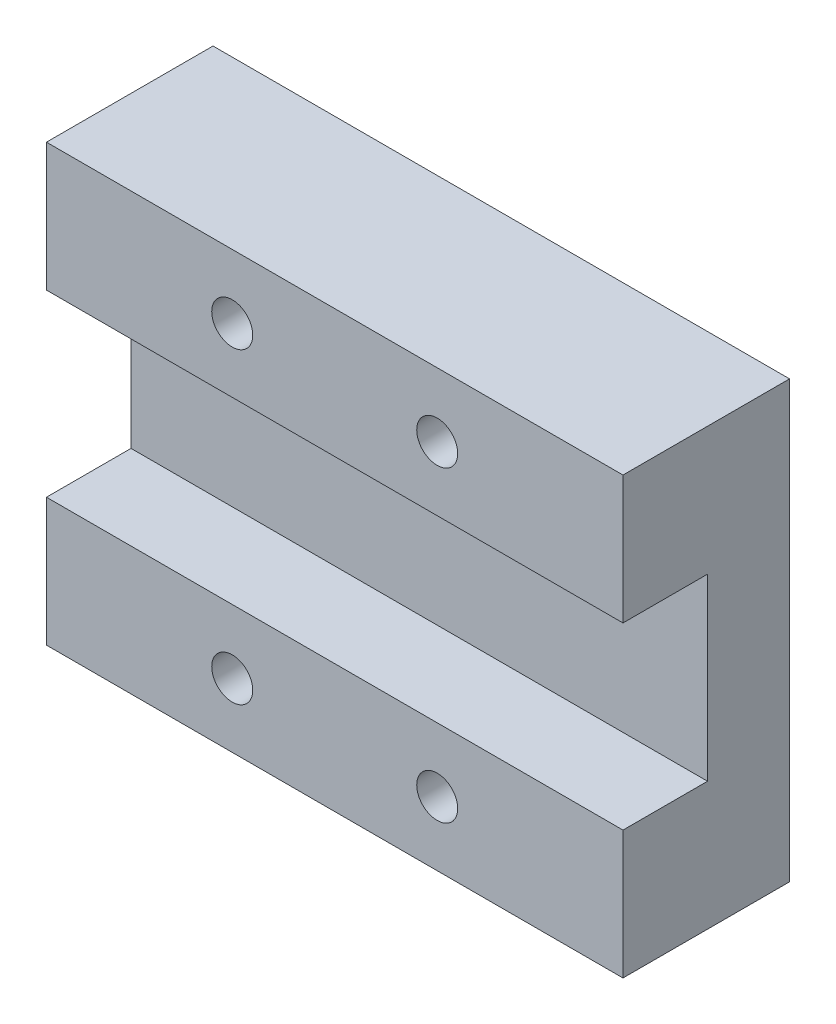
ISO-10303-21;
HEADER;
FILE_DESCRIPTION(('STEP AP214'),'2;1');
FILE_NAME('part.step','',(''),(''),'','','');
FILE_SCHEMA(('AUTOMOTIVE_DESIGN { 1 0 10303 214 1 1 1 1 }'));
ENDSEC;
DATA;
#1=APPLICATION_CONTEXT('core data for automotive mechanical design processes');
#2=APPLICATION_PROTOCOL_DEFINITION('international standard','automotive_design',2000,#1);
#3=PRODUCT_CONTEXT('',#1,'mechanical');
#4=PRODUCT('Part','Part','',(#3));
#5=PRODUCT_RELATED_PRODUCT_CATEGORY('part','',(#4));
#6=PRODUCT_DEFINITION_FORMATION('','',#4);
#7=PRODUCT_DEFINITION_CONTEXT('part definition',#1,'design');
#8=PRODUCT_DEFINITION('design','',#6,#7);
#9=PRODUCT_DEFINITION_SHAPE('','',#8);
#10=(LENGTH_UNIT() NAMED_UNIT(*) SI_UNIT(.MILLI.,.METRE.));
#11=(NAMED_UNIT(*) PLANE_ANGLE_UNIT() SI_UNIT($,.RADIAN.));
#12=(NAMED_UNIT(*) SI_UNIT($,.STERADIAN.) SOLID_ANGLE_UNIT());
#13=UNCERTAINTY_MEASURE_WITH_UNIT(LENGTH_MEASURE(1.E-05),#10,'distance_accuracy_value','');
#14=(GEOMETRIC_REPRESENTATION_CONTEXT(3) GLOBAL_UNCERTAINTY_ASSIGNED_CONTEXT((#13)) GLOBAL_UNIT_ASSIGNED_CONTEXT((#10,
#11,#12)) REPRESENTATION_CONTEXT('',''));
#15=CARTESIAN_POINT('',(0.,0.,0.));
#16=DIRECTION('',(0.,0.,1.));
#17=DIRECTION('',(1.,0.,0.));
#18=AXIS2_PLACEMENT_3D('',#15,#16,#17);
#19=CARTESIAN_POINT('',(0.,0.,6.5));
#20=DIRECTION('',(0.,0.,-1.));
#21=DIRECTION('',(-1.,0.,0.));
#22=AXIS2_PLACEMENT_3D('',#19,#20,#21);
#23=PLANE('',#22);
#24=CARTESIAN_POINT('',(15.25,2.5,6.5));
#25=DIRECTION('',(0.,0.,-1.));
#26=DIRECTION('',(-1.,0.,0.));
#27=AXIS2_PLACEMENT_3D('',#24,#25,#26);
#28=CIRCLE('',#27,0.799999999999999);
#29=CARTESIAN_POINT('',(14.45,2.5,6.5));
#30=VERTEX_POINT('',#29);
#31=EDGE_CURVE('E237',#30,#30,#28,.T.);
#32=ORIENTED_EDGE('',*,*,#31,.T.);
#33=EDGE_LOOP('',(#32));
#34=FACE_BOUND('',#33,.T.);
#35=CARTESIAN_POINT('',(7.24999999999999,2.5,6.5));
#36=DIRECTION('',(0.,0.,-1.));
#37=DIRECTION('',(-1.,0.,0.));
#38=AXIS2_PLACEMENT_3D('',#35,#36,#37);
#39=CIRCLE('',#38,0.799999999999999);
#40=CARTESIAN_POINT('',(6.44999999999999,2.5,6.5));
#41=VERTEX_POINT('',#40);
#42=EDGE_CURVE('E233',#41,#41,#39,.T.);
#43=ORIENTED_EDGE('',*,*,#42,.T.);
#44=EDGE_LOOP('',(#43));
#45=FACE_BOUND('',#44,.T.);
#46=DIRECTION('',(0.,1.,0.));
#47=VECTOR('',#46,1.);
#48=CARTESIAN_POINT('',(22.5,0.,6.5));
#49=LINE('',#48,#47);
#50=CARTESIAN_POINT('',(22.5,0.,6.5));
#51=VERTEX_POINT('',#50);
#52=CARTESIAN_POINT('',(22.5,5.00000000000001,6.5));
#53=VERTEX_POINT('',#52);
#54=EDGE_CURVE('E156',#51,#53,#49,.T.);
#55=ORIENTED_EDGE('',*,*,#54,.T.);
#56=DIRECTION('',(-1.,0.,0.));
#57=VECTOR('',#56,1.);
#58=CARTESIAN_POINT('',(22.5,5.00000000000001,6.5));
#59=LINE('',#58,#57);
#60=CARTESIAN_POINT('',(0.,5.,6.5));
#61=VERTEX_POINT('',#60);
#62=EDGE_CURVE('E147',#53,#61,#59,.T.);
#63=ORIENTED_EDGE('',*,*,#62,.T.);
#64=DIRECTION('',(0.,-1.,0.));
#65=VECTOR('',#64,1.);
#66=CARTESIAN_POINT('',(0.,0.,6.5));
#67=LINE('',#66,#65);
#68=CARTESIAN_POINT('',(0.,0.,6.5));
#69=VERTEX_POINT('',#68);
#70=EDGE_CURVE('E92',#61,#69,#67,.T.);
#71=ORIENTED_EDGE('',*,*,#70,.T.);
#72=DIRECTION('',(1.,0.,0.));
#73=VECTOR('',#72,1.);
#74=CARTESIAN_POINT('',(0.,0.,6.5));
#75=LINE('',#74,#73);
#76=EDGE_CURVE('E154',#69,#51,#75,.T.);
#77=ORIENTED_EDGE('',*,*,#76,.T.);
#78=EDGE_LOOP('',(#55,#63,#71,#77));
#79=FACE_BOUND('',#78,.T.);
#80=ADVANCED_FACE('F39',(#34,#45,#79),#23,.F.);
#81=CARTESIAN_POINT('',(0.,0.,6.5));
#82=DIRECTION('',(1.,0.,0.));
#83=DIRECTION('',(0.,1.,0.));
#84=AXIS2_PLACEMENT_3D('',#81,#82,#83);
#85=PLANE('',#84);
#86=ORIENTED_EDGE('',*,*,#70,.F.);
#87=DIRECTION('',(0.,0.,1.));
#88=VECTOR('',#87,1.);
#89=CARTESIAN_POINT('',(0.,5.,6.5));
#90=LINE('',#89,#88);
#91=CARTESIAN_POINT('',(0.,5.,3.2));
#92=VERTEX_POINT('',#91);
#93=EDGE_CURVE('E136',#92,#61,#90,.T.);
#94=ORIENTED_EDGE('',*,*,#93,.F.);
#95=DIRECTION('',(0.,-1.,0.));
#96=VECTOR('',#95,1.);
#97=CARTESIAN_POINT('',(0.,5.,3.2));
#98=LINE('',#97,#96);
#99=CARTESIAN_POINT('',(0.,12.,3.2));
#100=VERTEX_POINT('',#99);
#101=EDGE_CURVE('E138',#100,#92,#98,.T.);
#102=ORIENTED_EDGE('',*,*,#101,.F.);
#103=DIRECTION('',(0.,0.,-1.));
#104=VECTOR('',#103,1.);
#105=CARTESIAN_POINT('',(0.,12.,6.5));
#106=LINE('',#105,#104);
#107=CARTESIAN_POINT('',(0.,12.,6.5));
#108=VERTEX_POINT('',#107);
#109=EDGE_CURVE('E117',#108,#100,#106,.T.);
#110=ORIENTED_EDGE('',*,*,#109,.F.);
#111=CARTESIAN_POINT('',(0.,17.,6.5));
#112=VERTEX_POINT('',#111);
#113=EDGE_CURVE('E152',#112,#108,#67,.T.);
#114=ORIENTED_EDGE('',*,*,#113,.F.);
#115=DIRECTION('',(0.,0.,-1.));
#116=VECTOR('',#115,1.);
#117=CARTESIAN_POINT('',(0.,17.,6.5));
#118=LINE('',#117,#116);
#119=CARTESIAN_POINT('',(0.,17.,0.));
#120=VERTEX_POINT('',#119);
#121=EDGE_CURVE('E160',#112,#120,#118,.T.);
#122=ORIENTED_EDGE('',*,*,#121,.T.);
#123=DIRECTION('',(0.,-1.,0.));
#124=VECTOR('',#123,1.);
#125=CARTESIAN_POINT('',(0.,0.,0.));
#126=LINE('',#125,#124);
#127=CARTESIAN_POINT('',(0.,0.,0.));
#128=VERTEX_POINT('',#127);
#129=EDGE_CURVE('E149',#120,#128,#126,.T.);
#130=ORIENTED_EDGE('',*,*,#129,.T.);
#131=DIRECTION('',(0.,0.,-1.));
#132=VECTOR('',#131,1.);
#133=CARTESIAN_POINT('',(0.,0.,6.5));
#134=LINE('',#133,#132);
#135=EDGE_CURVE('E11',#69,#128,#134,.T.);
#136=ORIENTED_EDGE('',*,*,#135,.F.);
#137=EDGE_LOOP('',(#86,#94,#102,#110,#114,#122,#130,#136));
#138=FACE_BOUND('',#137,.T.);
#139=ADVANCED_FACE('F41',(#138),#85,.F.);
#140=CARTESIAN_POINT('',(0.,0.,6.5));
#141=DIRECTION('',(0.,1.,0.));
#142=DIRECTION('',(0.,0.,1.));
#143=AXIS2_PLACEMENT_3D('',#140,#141,#142);
#144=PLANE('',#143);
#145=DIRECTION('',(1.,0.,0.));
#146=VECTOR('',#145,1.);
#147=CARTESIAN_POINT('',(0.,0.,0.));
#148=LINE('',#147,#146);
#149=CARTESIAN_POINT('',(22.5,0.,0.));
#150=VERTEX_POINT('',#149);
#151=EDGE_CURVE('E163',#128,#150,#148,.T.);
#152=ORIENTED_EDGE('',*,*,#151,.T.);
#153=DIRECTION('',(0.,0.,-1.));
#154=VECTOR('',#153,1.);
#155=CARTESIAN_POINT('',(22.5,0.,6.5));
#156=LINE('',#155,#154);
#157=EDGE_CURVE('E47',#51,#150,#156,.T.);
#158=ORIENTED_EDGE('',*,*,#157,.F.);
#159=ORIENTED_EDGE('',*,*,#76,.F.);
#160=ORIENTED_EDGE('',*,*,#135,.T.);
#161=EDGE_LOOP('',(#152,#158,#159,#160));
#162=FACE_BOUND('',#161,.T.);
#163=ADVANCED_FACE('F191',(#162),#144,.F.);
#164=CARTESIAN_POINT('',(22.5,0.,6.5));
#165=DIRECTION('',(-1.,0.,0.));
#166=DIRECTION('',(0.,-1.,0.));
#167=AXIS2_PLACEMENT_3D('',#164,#165,#166);
#168=PLANE('',#167);
#169=DIRECTION('',(0.,-1.,0.));
#170=VECTOR('',#169,1.);
#171=CARTESIAN_POINT('',(22.5,5.00000000000001,3.2));
#172=LINE('',#171,#170);
#173=CARTESIAN_POINT('',(22.5,12.,3.2));
#174=VERTEX_POINT('',#173);
#175=CARTESIAN_POINT('',(22.5,5.00000000000001,3.2));
#176=VERTEX_POINT('',#175);
#177=EDGE_CURVE('E125',#174,#176,#172,.T.);
#178=ORIENTED_EDGE('',*,*,#177,.T.);
#179=DIRECTION('',(0.,0.,1.));
#180=VECTOR('',#179,1.);
#181=CARTESIAN_POINT('',(22.5,5.00000000000001,6.5));
#182=LINE('',#181,#180);
#183=EDGE_CURVE('E130',#176,#53,#182,.T.);
#184=ORIENTED_EDGE('',*,*,#183,.T.);
#185=ORIENTED_EDGE('',*,*,#54,.F.);
#186=ORIENTED_EDGE('',*,*,#157,.T.);
#187=DIRECTION('',(0.,1.,0.));
#188=VECTOR('',#187,1.);
#189=CARTESIAN_POINT('',(22.5,0.,0.));
#190=LINE('',#189,#188);
#191=CARTESIAN_POINT('',(22.5,17.,0.));
#192=VERTEX_POINT('',#191);
#193=EDGE_CURVE('E165',#150,#192,#190,.T.);
#194=ORIENTED_EDGE('',*,*,#193,.T.);
#195=DIRECTION('',(0.,0.,-1.));
#196=VECTOR('',#195,1.);
#197=CARTESIAN_POINT('',(22.5,17.,6.5));
#198=LINE('',#197,#196);
#199=CARTESIAN_POINT('',(22.5,17.,6.5));
#200=VERTEX_POINT('',#199);
#201=EDGE_CURVE('E169',#200,#192,#198,.T.);
#202=ORIENTED_EDGE('',*,*,#201,.F.);
#203=CARTESIAN_POINT('',(22.5,12.,6.5));
#204=VERTEX_POINT('',#203);
#205=EDGE_CURVE('E135',#204,#200,#49,.T.);
#206=ORIENTED_EDGE('',*,*,#205,.F.);
#207=DIRECTION('',(0.,0.,-1.));
#208=VECTOR('',#207,1.);
#209=CARTESIAN_POINT('',(22.5,12.,6.5));
#210=LINE('',#209,#208);
#211=EDGE_CURVE('E54',#204,#174,#210,.T.);
#212=ORIENTED_EDGE('',*,*,#211,.T.);
#213=EDGE_LOOP('',(#178,#184,#185,#186,#194,#202,#206,#212));
#214=FACE_BOUND('',#213,.T.);
#215=ADVANCED_FACE('F133',(#214),#168,.F.);
#216=CARTESIAN_POINT('',(0.,17.,6.5));
#217=DIRECTION('',(0.,-1.,0.));
#218=DIRECTION('',(0.,0.,-1.));
#219=AXIS2_PLACEMENT_3D('',#216,#217,#218);
#220=PLANE('',#219);
#221=DIRECTION('',(-1.,0.,0.));
#222=VECTOR('',#221,1.);
#223=CARTESIAN_POINT('',(0.,17.,0.));
#224=LINE('',#223,#222);
#225=EDGE_CURVE('E84',#192,#120,#224,.T.);
#226=ORIENTED_EDGE('',*,*,#225,.T.);
#227=ORIENTED_EDGE('',*,*,#121,.F.);
#228=DIRECTION('',(-1.,0.,0.));
#229=VECTOR('',#228,1.);
#230=CARTESIAN_POINT('',(0.,17.,6.5));
#231=LINE('',#230,#229);
#232=EDGE_CURVE('E63',#200,#112,#231,.T.);
#233=ORIENTED_EDGE('',*,*,#232,.F.);
#234=ORIENTED_EDGE('',*,*,#201,.T.);
#235=EDGE_LOOP('',(#226,#227,#233,#234));
#236=FACE_BOUND('',#235,.T.);
#237=ADVANCED_FACE('F181',(#236),#220,.F.);
#238=CARTESIAN_POINT('',(15.25,14.5,6.5));
#239=DIRECTION('',(0.,0.,-1.));
#240=DIRECTION('',(-1.,0.,0.));
#241=AXIS2_PLACEMENT_3D('',#238,#239,#240);
#242=CIRCLE('',#241,0.799999999999999);
#243=CARTESIAN_POINT('',(14.45,14.5,6.5));
#244=VERTEX_POINT('',#243);
#245=EDGE_CURVE('E227',#244,#244,#242,.T.);
#246=ORIENTED_EDGE('',*,*,#245,.T.);
#247=EDGE_LOOP('',(#246));
#248=FACE_BOUND('',#247,.T.);
#249=CARTESIAN_POINT('',(7.24999999999999,14.5,6.5));
#250=DIRECTION('',(0.,0.,-1.));
#251=DIRECTION('',(-1.,0.,0.));
#252=AXIS2_PLACEMENT_3D('',#249,#250,#251);
#253=CIRCLE('',#252,0.799999999999998);
#254=CARTESIAN_POINT('',(6.44999999999999,14.5,6.5));
#255=VERTEX_POINT('',#254);
#256=EDGE_CURVE('E141',#255,#255,#253,.T.);
#257=ORIENTED_EDGE('',*,*,#256,.T.);
#258=EDGE_LOOP('',(#257));
#259=FACE_BOUND('',#258,.T.);
#260=ORIENTED_EDGE('',*,*,#113,.T.);
#261=DIRECTION('',(-1.,0.,0.));
#262=VECTOR('',#261,1.);
#263=CARTESIAN_POINT('',(22.5,12.,6.5));
#264=LINE('',#263,#262);
#265=EDGE_CURVE('E122',#204,#108,#264,.T.);
#266=ORIENTED_EDGE('',*,*,#265,.F.);
#267=ORIENTED_EDGE('',*,*,#205,.T.);
#268=ORIENTED_EDGE('',*,*,#232,.T.);
#269=EDGE_LOOP('',(#260,#266,#267,#268));
#270=FACE_BOUND('',#269,.T.);
#271=ADVANCED_FACE('F183',(#248,#259,#270),#23,.F.);
#272=CARTESIAN_POINT('',(0.,0.,0.));
#273=DIRECTION('',(0.,0.,-1.));
#274=DIRECTION('',(-1.,0.,0.));
#275=AXIS2_PLACEMENT_3D('',#272,#273,#274);
#276=PLANE('',#275);
#277=CARTESIAN_POINT('',(15.25,2.5,0.));
#278=DIRECTION('',(0.,0.,-1.));
#279=DIRECTION('',(-1.,0.,0.));
#280=AXIS2_PLACEMENT_3D('',#277,#278,#279);
#281=CIRCLE('',#280,0.799999999999999);
#282=CARTESIAN_POINT('',(14.45,2.5,0.));
#283=VERTEX_POINT('',#282);
#284=EDGE_CURVE('E214',#283,#283,#281,.T.);
#285=ORIENTED_EDGE('',*,*,#284,.F.);
#286=EDGE_LOOP('',(#285));
#287=FACE_BOUND('',#286,.T.);
#288=CARTESIAN_POINT('',(7.24999999999999,2.5,0.));
#289=DIRECTION('',(0.,0.,-1.));
#290=DIRECTION('',(-1.,0.,0.));
#291=AXIS2_PLACEMENT_3D('',#288,#289,#290);
#292=CIRCLE('',#291,0.799999999999999);
#293=CARTESIAN_POINT('',(6.44999999999999,2.5,0.));
#294=VERTEX_POINT('',#293);
#295=EDGE_CURVE('E218',#294,#294,#292,.T.);
#296=ORIENTED_EDGE('',*,*,#295,.F.);
#297=EDGE_LOOP('',(#296));
#298=FACE_BOUND('',#297,.T.);
#299=CARTESIAN_POINT('',(15.25,14.5,0.));
#300=DIRECTION('',(0.,0.,-1.));
#301=DIRECTION('',(-1.,0.,0.));
#302=AXIS2_PLACEMENT_3D('',#299,#300,#301);
#303=CIRCLE('',#302,0.799999999999999);
#304=CARTESIAN_POINT('',(14.45,14.5,0.));
#305=VERTEX_POINT('',#304);
#306=EDGE_CURVE('E222',#305,#305,#303,.T.);
#307=ORIENTED_EDGE('',*,*,#306,.F.);
#308=EDGE_LOOP('',(#307));
#309=FACE_BOUND('',#308,.T.);
#310=CARTESIAN_POINT('',(7.24999999999999,14.5,0.));
#311=DIRECTION('',(0.,0.,-1.));
#312=DIRECTION('',(-1.,0.,0.));
#313=AXIS2_PLACEMENT_3D('',#310,#311,#312);
#314=CIRCLE('',#313,0.799999999999999);
#315=CARTESIAN_POINT('',(6.44999999999999,14.5,0.));
#316=VERTEX_POINT('',#315);
#317=EDGE_CURVE('E225',#316,#316,#314,.T.);
#318=ORIENTED_EDGE('',*,*,#317,.F.);
#319=EDGE_LOOP('',(#318));
#320=FACE_BOUND('',#319,.T.);
#321=ORIENTED_EDGE('',*,*,#129,.F.);
#322=ORIENTED_EDGE('',*,*,#225,.F.);
#323=ORIENTED_EDGE('',*,*,#193,.F.);
#324=ORIENTED_EDGE('',*,*,#151,.F.);
#325=EDGE_LOOP('',(#321,#322,#323,#324));
#326=FACE_BOUND('',#325,.T.);
#327=ADVANCED_FACE('F177',(#287,#298,#309,#320,#326),#276,.T.);
#328=CARTESIAN_POINT('',(22.5,5.00000000000001,6.5));
#329=DIRECTION('',(0.,-1.,0.));
#330=DIRECTION('',(1.,0.,0.));
#331=AXIS2_PLACEMENT_3D('',#328,#329,#330);
#332=PLANE('',#331);
#333=ORIENTED_EDGE('',*,*,#93,.T.);
#334=ORIENTED_EDGE('',*,*,#62,.F.);
#335=ORIENTED_EDGE('',*,*,#183,.F.);
#336=DIRECTION('',(-1.,0.,0.));
#337=VECTOR('',#336,1.);
#338=CARTESIAN_POINT('',(22.5,5.00000000000001,3.2));
#339=LINE('',#338,#337);
#340=EDGE_CURVE('E121',#176,#92,#339,.T.);
#341=ORIENTED_EDGE('',*,*,#340,.T.);
#342=EDGE_LOOP('',(#333,#334,#335,#341));
#343=FACE_BOUND('',#342,.T.);
#344=ADVANCED_FACE('F204',(#343),#332,.F.);
#345=CARTESIAN_POINT('',(22.5,5.00000000000001,3.2));
#346=DIRECTION('',(0.,0.,-1.));
#347=DIRECTION('',(-1.,0.,0.));
#348=AXIS2_PLACEMENT_3D('',#345,#346,#347);
#349=PLANE('',#348);
#350=ORIENTED_EDGE('',*,*,#101,.T.);
#351=ORIENTED_EDGE('',*,*,#340,.F.);
#352=ORIENTED_EDGE('',*,*,#177,.F.);
#353=DIRECTION('',(-1.,0.,0.));
#354=VECTOR('',#353,1.);
#355=CARTESIAN_POINT('',(22.5,12.,3.2));
#356=LINE('',#355,#354);
#357=EDGE_CURVE('E113',#174,#100,#356,.T.);
#358=ORIENTED_EDGE('',*,*,#357,.T.);
#359=EDGE_LOOP('',(#350,#351,#352,#358));
#360=FACE_BOUND('',#359,.T.);
#361=ADVANCED_FACE('F126',(#360),#349,.F.);
#362=CARTESIAN_POINT('',(22.5,12.,6.5));
#363=DIRECTION('',(0.,1.,0.));
#364=DIRECTION('',(-1.,0.,0.));
#365=AXIS2_PLACEMENT_3D('',#362,#363,#364);
#366=PLANE('',#365);
#367=ORIENTED_EDGE('',*,*,#109,.T.);
#368=ORIENTED_EDGE('',*,*,#357,.F.);
#369=ORIENTED_EDGE('',*,*,#211,.F.);
#370=ORIENTED_EDGE('',*,*,#265,.T.);
#371=EDGE_LOOP('',(#367,#368,#369,#370));
#372=FACE_BOUND('',#371,.T.);
#373=ADVANCED_FACE('F115',(#372),#366,.F.);
#374=CARTESIAN_POINT('',(7.24999999999999,14.5,0.));
#375=DIRECTION('',(0.,0.,-1.));
#376=DIRECTION('',(-1.,0.,0.));
#377=AXIS2_PLACEMENT_3D('',#374,#375,#376);
#378=CYLINDRICAL_SURFACE('',#377,0.799999999999998);
#379=ORIENTED_EDGE('',*,*,#317,.T.);
#380=EDGE_LOOP('',(#379));
#381=FACE_BOUND('',#380,.T.);
#382=ORIENTED_EDGE('',*,*,#256,.F.);
#383=EDGE_LOOP('',(#382));
#384=FACE_BOUND('',#383,.T.);
#385=ADVANCED_FACE('F255',(#381,#384),#378,.F.);
#386=CARTESIAN_POINT('',(15.25,14.5,0.));
#387=DIRECTION('',(0.,0.,-1.));
#388=DIRECTION('',(-1.,0.,0.));
#389=AXIS2_PLACEMENT_3D('',#386,#387,#388);
#390=CYLINDRICAL_SURFACE('',#389,0.799999999999999);
#391=ORIENTED_EDGE('',*,*,#306,.T.);
#392=EDGE_LOOP('',(#391));
#393=FACE_BOUND('',#392,.T.);
#394=ORIENTED_EDGE('',*,*,#245,.F.);
#395=EDGE_LOOP('',(#394));
#396=FACE_BOUND('',#395,.T.);
#397=ADVANCED_FACE('F249',(#393,#396),#390,.F.);
#398=CARTESIAN_POINT('',(7.24999999999999,2.5,0.));
#399=DIRECTION('',(0.,0.,-1.));
#400=DIRECTION('',(-1.,0.,0.));
#401=AXIS2_PLACEMENT_3D('',#398,#399,#400);
#402=CYLINDRICAL_SURFACE('',#401,0.799999999999999);
#403=ORIENTED_EDGE('',*,*,#295,.T.);
#404=EDGE_LOOP('',(#403));
#405=FACE_BOUND('',#404,.T.);
#406=ORIENTED_EDGE('',*,*,#42,.F.);
#407=EDGE_LOOP('',(#406));
#408=FACE_BOUND('',#407,.T.);
#409=ADVANCED_FACE('F243',(#405,#408),#402,.F.);
#410=CARTESIAN_POINT('',(15.25,2.5,0.));
#411=DIRECTION('',(0.,0.,-1.));
#412=DIRECTION('',(-1.,0.,0.));
#413=AXIS2_PLACEMENT_3D('',#410,#411,#412);
#414=CYLINDRICAL_SURFACE('',#413,0.799999999999999);
#415=ORIENTED_EDGE('',*,*,#284,.T.);
#416=EDGE_LOOP('',(#415));
#417=FACE_BOUND('',#416,.T.);
#418=ORIENTED_EDGE('',*,*,#31,.F.);
#419=EDGE_LOOP('',(#418));
#420=FACE_BOUND('',#419,.T.);
#421=ADVANCED_FACE('F240',(#417,#420),#414,.F.);
#422=CLOSED_SHELL('',(#80,#139,#163,#215,#237,#271,#327,#344,#361,#373,#385,#397,#409,#421));
#423=MANIFOLD_SOLID_BREP('B2',#422);
#424=ADVANCED_BREP_SHAPE_REPRESENTATION('',(#18,#423),#14);
#425=SHAPE_DEFINITION_REPRESENTATION(#9,#424);
ENDSEC;
END-ISO-10303-21;
